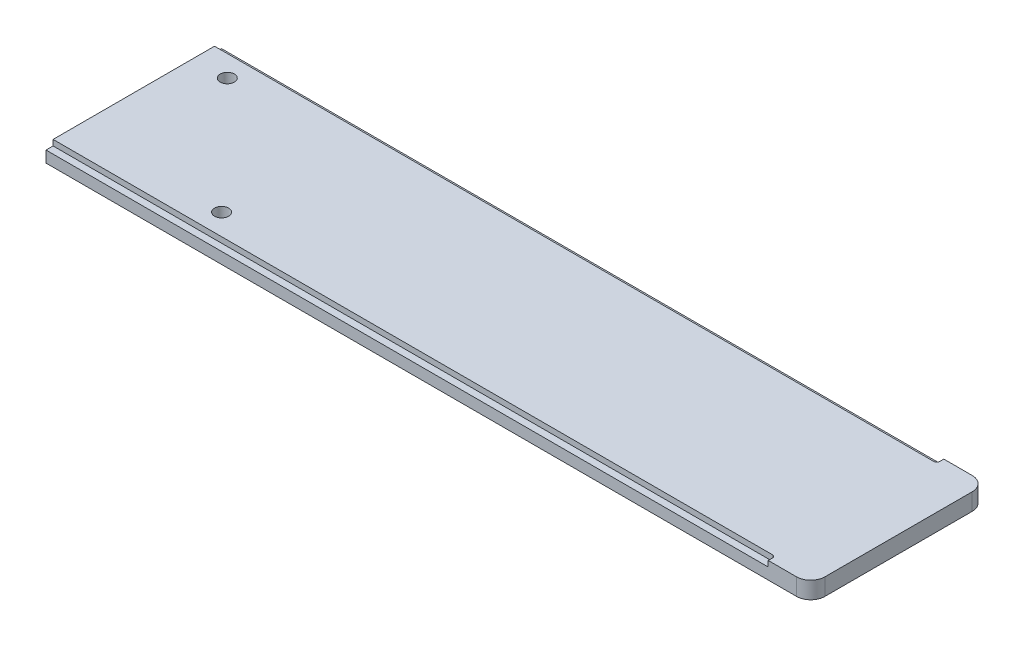
ISO-10303-21;
HEADER;
FILE_DESCRIPTION(('STEP AP214'),'2;1');
FILE_NAME('part.step','',(''),(''),'','','');
FILE_SCHEMA(('AUTOMOTIVE_DESIGN { 1 0 10303 214 1 1 1 1 }'));
ENDSEC;
DATA;
#1=APPLICATION_CONTEXT('core data for automotive mechanical design processes');
#2=APPLICATION_PROTOCOL_DEFINITION('international standard','automotive_design',2000,#1);
#3=PRODUCT_CONTEXT('',#1,'mechanical');
#4=PRODUCT('Part','Part','',(#3));
#5=PRODUCT_RELATED_PRODUCT_CATEGORY('part','',(#4));
#6=PRODUCT_DEFINITION_FORMATION('','',#4);
#7=PRODUCT_DEFINITION_CONTEXT('part definition',#1,'design');
#8=PRODUCT_DEFINITION('design','',#6,#7);
#9=PRODUCT_DEFINITION_SHAPE('','',#8);
#10=(LENGTH_UNIT() NAMED_UNIT(*) SI_UNIT(.MILLI.,.METRE.));
#11=(NAMED_UNIT(*) PLANE_ANGLE_UNIT() SI_UNIT($,.RADIAN.));
#12=(NAMED_UNIT(*) SI_UNIT($,.STERADIAN.) SOLID_ANGLE_UNIT());
#13=UNCERTAINTY_MEASURE_WITH_UNIT(LENGTH_MEASURE(1.E-05),#10,'distance_accuracy_value','');
#14=(GEOMETRIC_REPRESENTATION_CONTEXT(3) GLOBAL_UNCERTAINTY_ASSIGNED_CONTEXT((#13)) GLOBAL_UNIT_ASSIGNED_CONTEXT((#10,
#11,#12)) REPRESENTATION_CONTEXT('',''));
#15=CARTESIAN_POINT('',(0.,0.,0.));
#16=DIRECTION('',(0.,0.,1.));
#17=DIRECTION('',(1.,0.,0.));
#18=AXIS2_PLACEMENT_3D('',#15,#16,#17);
#19=CARTESIAN_POINT('',(0.,6.,0.));
#20=DIRECTION('',(1.,0.,0.));
#21=DIRECTION('',(0.,0.,-1.));
#22=AXIS2_PLACEMENT_3D('',#19,#20,#21);
#23=PLANE('',#22);
#24=DIRECTION('',(0.,0.,1.));
#25=VECTOR('',#24,1.);
#26=CARTESIAN_POINT('',(0.,6.,0.));
#27=LINE('',#26,#25);
#28=CARTESIAN_POINT('',(0.,6.,-59.5));
#29=VERTEX_POINT('',#28);
#30=CARTESIAN_POINT('',(0.,6.,-2.5));
#31=VERTEX_POINT('',#30);
#32=EDGE_CURVE('E167',#29,#31,#27,.T.);
#33=ORIENTED_EDGE('',*,*,#32,.F.);
#34=DIRECTION('',(0.,1.,0.));
#35=VECTOR('',#34,1.);
#36=CARTESIAN_POINT('',(0.,4.,-59.5));
#37=LINE('',#36,#35);
#38=CARTESIAN_POINT('',(0.,4.,-59.5));
#39=VERTEX_POINT('',#38);
#40=EDGE_CURVE('E146',#39,#29,#37,.T.);
#41=ORIENTED_EDGE('',*,*,#40,.F.);
#42=DIRECTION('',(0.,0.,1.));
#43=VECTOR('',#42,1.);
#44=CARTESIAN_POINT('',(0.,4.,-62.));
#45=LINE('',#44,#43);
#46=CARTESIAN_POINT('',(0.,4.,-62.));
#47=VERTEX_POINT('',#46);
#48=EDGE_CURVE('E153',#47,#39,#45,.T.);
#49=ORIENTED_EDGE('',*,*,#48,.F.);
#50=DIRECTION('',(0.,-1.,0.));
#51=VECTOR('',#50,1.);
#52=CARTESIAN_POINT('',(0.,6.,-62.));
#53=LINE('',#52,#51);
#54=CARTESIAN_POINT('',(0.,0.,-62.));
#55=VERTEX_POINT('',#54);
#56=EDGE_CURVE('E205',#47,#55,#53,.T.);
#57=ORIENTED_EDGE('',*,*,#56,.T.);
#58=DIRECTION('',(0.,0.,1.));
#59=VECTOR('',#58,1.);
#60=CARTESIAN_POINT('',(0.,0.,0.));
#61=LINE('',#60,#59);
#62=CARTESIAN_POINT('',(0.,0.,0.));
#63=VERTEX_POINT('',#62);
#64=EDGE_CURVE('E171',#55,#63,#61,.T.);
#65=ORIENTED_EDGE('',*,*,#64,.T.);
#66=DIRECTION('',(0.,-1.,0.));
#67=VECTOR('',#66,1.);
#68=CARTESIAN_POINT('',(0.,6.,0.));
#69=LINE('',#68,#67);
#70=CARTESIAN_POINT('',(0.,4.,0.));
#71=VERTEX_POINT('',#70);
#72=EDGE_CURVE('E214',#71,#63,#69,.T.);
#73=ORIENTED_EDGE('',*,*,#72,.F.);
#74=DIRECTION('',(0.,0.,1.));
#75=VECTOR('',#74,1.);
#76=CARTESIAN_POINT('',(0.,4.,0.));
#77=LINE('',#76,#75);
#78=CARTESIAN_POINT('',(0.,4.,-2.5));
#79=VERTEX_POINT('',#78);
#80=EDGE_CURVE('E185',#79,#71,#77,.T.);
#81=ORIENTED_EDGE('',*,*,#80,.F.);
#82=DIRECTION('',(0.,1.,0.));
#83=VECTOR('',#82,1.);
#84=CARTESIAN_POINT('',(0.,4.,-2.5));
#85=LINE('',#84,#83);
#86=EDGE_CURVE('E179',#79,#31,#85,.T.);
#87=ORIENTED_EDGE('',*,*,#86,.T.);
#88=EDGE_LOOP('',(#33,#41,#49,#57,#65,#73,#81,#87));
#89=FACE_BOUND('',#88,.T.);
#90=ADVANCED_FACE('F39',(#89),#23,.F.);
#91=CARTESIAN_POINT('',(0.,6.,0.));
#92=DIRECTION('',(0.,0.,-1.));
#93=DIRECTION('',(-1.,0.,0.));
#94=AXIS2_PLACEMENT_3D('',#91,#92,#93);
#95=PLANE('',#94);
#96=DIRECTION('',(1.,0.,0.));
#97=VECTOR('',#96,1.);
#98=CARTESIAN_POINT('',(0.,0.,0.));
#99=LINE('',#98,#97);
#100=CARTESIAN_POINT('',(265.,0.,0.));
#101=VERTEX_POINT('',#100);
#102=EDGE_CURVE('E208',#63,#101,#99,.T.);
#103=ORIENTED_EDGE('',*,*,#102,.T.);
#104=DIRECTION('',(0.,-1.,0.));
#105=VECTOR('',#104,1.);
#106=CARTESIAN_POINT('',(265.,6.,0.));
#107=LINE('',#106,#105);
#108=CARTESIAN_POINT('',(265.,6.,0.));
#109=VERTEX_POINT('',#108);
#110=EDGE_CURVE('E11',#101,#109,#107,.F.);
#111=ORIENTED_EDGE('',*,*,#110,.T.);
#112=DIRECTION('',(1.,0.,0.));
#113=VECTOR('',#112,1.);
#114=CARTESIAN_POINT('',(0.,6.,0.));
#115=LINE('',#114,#113);
#116=CARTESIAN_POINT('',(255.,6.,0.));
#117=VERTEX_POINT('',#116);
#118=EDGE_CURVE('E198',#117,#109,#115,.T.);
#119=ORIENTED_EDGE('',*,*,#118,.F.);
#120=DIRECTION('',(0.,1.,0.));
#121=VECTOR('',#120,1.);
#122=CARTESIAN_POINT('',(255.,4.,0.));
#123=LINE('',#122,#121);
#124=CARTESIAN_POINT('',(255.,4.,0.));
#125=VERTEX_POINT('',#124);
#126=EDGE_CURVE('E176',#125,#117,#123,.T.);
#127=ORIENTED_EDGE('',*,*,#126,.F.);
#128=DIRECTION('',(1.,0.,0.));
#129=VECTOR('',#128,1.);
#130=CARTESIAN_POINT('',(0.,4.,0.));
#131=LINE('',#130,#129);
#132=EDGE_CURVE('E193',#71,#125,#131,.T.);
#133=ORIENTED_EDGE('',*,*,#132,.F.);
#134=ORIENTED_EDGE('',*,*,#72,.T.);
#135=EDGE_LOOP('',(#103,#111,#119,#127,#133,#134));
#136=FACE_BOUND('',#135,.T.);
#137=ADVANCED_FACE('F267',(#136),#95,.F.);
#138=CARTESIAN_POINT('',(270.,6.,0.));
#139=DIRECTION('',(-1.,0.,0.));
#140=DIRECTION('',(0.,0.,1.));
#141=AXIS2_PLACEMENT_3D('',#138,#139,#140);
#142=PLANE('',#141);
#143=DIRECTION('',(0.,0.,-1.));
#144=VECTOR('',#143,1.);
#145=CARTESIAN_POINT('',(270.,0.,0.));
#146=LINE('',#145,#144);
#147=CARTESIAN_POINT('',(270.,0.,-5.));
#148=VERTEX_POINT('',#147);
#149=CARTESIAN_POINT('',(270.,0.,-57.));
#150=VERTEX_POINT('',#149);
#151=EDGE_CURVE('E210',#148,#150,#146,.T.);
#152=ORIENTED_EDGE('',*,*,#151,.T.);
#153=DIRECTION('',(0.,-1.,0.));
#154=VECTOR('',#153,1.);
#155=CARTESIAN_POINT('',(270.,6.,-57.));
#156=LINE('',#155,#154);
#157=CARTESIAN_POINT('',(270.,6.,-57.));
#158=VERTEX_POINT('',#157);
#159=EDGE_CURVE('E60',#150,#158,#156,.F.);
#160=ORIENTED_EDGE('',*,*,#159,.T.);
#161=DIRECTION('',(0.,0.,-1.));
#162=VECTOR('',#161,1.);
#163=CARTESIAN_POINT('',(270.,6.,0.));
#164=LINE('',#163,#162);
#165=CARTESIAN_POINT('',(270.,6.,-5.));
#166=VERTEX_POINT('',#165);
#167=EDGE_CURVE('E201',#166,#158,#164,.T.);
#168=ORIENTED_EDGE('',*,*,#167,.F.);
#169=DIRECTION('',(0.,-1.,0.));
#170=VECTOR('',#169,1.);
#171=CARTESIAN_POINT('',(270.,6.,-5.));
#172=LINE('',#171,#170);
#173=EDGE_CURVE('E240',#166,#148,#172,.T.);
#174=ORIENTED_EDGE('',*,*,#173,.T.);
#175=EDGE_LOOP('',(#152,#160,#168,#174));
#176=FACE_BOUND('',#175,.T.);
#177=ADVANCED_FACE('F262',(#176),#142,.F.);
#178=CARTESIAN_POINT('',(0.,6.,-62.));
#179=DIRECTION('',(0.,0.,1.));
#180=DIRECTION('',(1.,0.,0.));
#181=AXIS2_PLACEMENT_3D('',#178,#179,#180);
#182=PLANE('',#181);
#183=DIRECTION('',(-1.,0.,0.));
#184=VECTOR('',#183,1.);
#185=CARTESIAN_POINT('',(0.,6.,-62.));
#186=LINE('',#185,#184);
#187=CARTESIAN_POINT('',(265.,6.,-62.));
#188=VERTEX_POINT('',#187);
#189=CARTESIAN_POINT('',(255.,6.,-62.));
#190=VERTEX_POINT('',#189);
#191=EDGE_CURVE('E203',#188,#190,#186,.T.);
#192=ORIENTED_EDGE('',*,*,#191,.F.);
#193=DIRECTION('',(0.,-1.,0.));
#194=VECTOR('',#193,1.);
#195=CARTESIAN_POINT('',(265.,6.,-62.));
#196=LINE('',#195,#194);
#197=CARTESIAN_POINT('',(265.,0.,-62.));
#198=VERTEX_POINT('',#197);
#199=EDGE_CURVE('E233',#188,#198,#196,.T.);
#200=ORIENTED_EDGE('',*,*,#199,.T.);
#201=DIRECTION('',(-1.,0.,0.));
#202=VECTOR('',#201,1.);
#203=CARTESIAN_POINT('',(0.,0.,-62.));
#204=LINE('',#203,#202);
#205=EDGE_CURVE('E199',#198,#55,#204,.T.);
#206=ORIENTED_EDGE('',*,*,#205,.T.);
#207=ORIENTED_EDGE('',*,*,#56,.F.);
#208=DIRECTION('',(-1.,0.,0.));
#209=VECTOR('',#208,1.);
#210=CARTESIAN_POINT('',(0.,4.,-62.));
#211=LINE('',#210,#209);
#212=CARTESIAN_POINT('',(255.,4.,-62.));
#213=VERTEX_POINT('',#212);
#214=EDGE_CURVE('E158',#213,#47,#211,.T.);
#215=ORIENTED_EDGE('',*,*,#214,.F.);
#216=DIRECTION('',(0.,1.,0.));
#217=VECTOR('',#216,1.);
#218=CARTESIAN_POINT('',(255.,4.,-62.));
#219=LINE('',#218,#217);
#220=EDGE_CURVE('E168',#213,#190,#219,.T.);
#221=ORIENTED_EDGE('',*,*,#220,.T.);
#222=EDGE_LOOP('',(#192,#200,#206,#207,#215,#221));
#223=FACE_BOUND('',#222,.T.);
#224=ADVANCED_FACE('F254',(#223),#182,.F.);
#225=CARTESIAN_POINT('',(0.,6.,0.));
#226=DIRECTION('',(0.,-1.,0.));
#227=DIRECTION('',(0.,0.,-1.));
#228=AXIS2_PLACEMENT_3D('',#225,#226,#227);
#229=PLANE('',#228);
#230=CARTESIAN_POINT('',(12.,6.,-52.));
#231=DIRECTION('',(0.,1.,0.));
#232=DIRECTION('',(0.,0.,1.));
#233=AXIS2_PLACEMENT_3D('',#230,#231,#232);
#234=CIRCLE('',#233,2.5);
#235=CARTESIAN_POINT('',(12.,6.,-49.5));
#236=VERTEX_POINT('',#235);
#237=EDGE_CURVE('E291',#236,#236,#234,.T.);
#238=ORIENTED_EDGE('',*,*,#237,.F.);
#239=EDGE_LOOP('',(#238));
#240=FACE_BOUND('',#239,.T.);
#241=CARTESIAN_POINT('',(52.,6.,-10.));
#242=DIRECTION('',(0.,1.,0.));
#243=DIRECTION('',(0.,0.,1.));
#244=AXIS2_PLACEMENT_3D('',#241,#242,#243);
#245=CIRCLE('',#244,2.49999999999999);
#246=CARTESIAN_POINT('',(52.,6.,-7.50000000000001));
#247=VERTEX_POINT('',#246);
#248=EDGE_CURVE('E288',#247,#247,#245,.T.);
#249=ORIENTED_EDGE('',*,*,#248,.F.);
#250=EDGE_LOOP('',(#249));
#251=FACE_BOUND('',#250,.T.);
#252=ORIENTED_EDGE('',*,*,#167,.T.);
#253=CARTESIAN_POINT('',(265.,6.,-57.));
#254=DIRECTION('',(0.,-1.,0.));
#255=DIRECTION('',(0.,0.,-1.));
#256=AXIS2_PLACEMENT_3D('',#253,#254,#255);
#257=CIRCLE('',#256,5.);
#258=EDGE_CURVE('E47',#158,#188,#257,.F.);
#259=ORIENTED_EDGE('',*,*,#258,.T.);
#260=ORIENTED_EDGE('',*,*,#191,.T.);
#261=DIRECTION('',(0.,0.,-1.));
#262=VECTOR('',#261,1.);
#263=CARTESIAN_POINT('',(255.,6.,-62.));
#264=LINE('',#263,#262);
#265=CARTESIAN_POINT('',(255.,6.,-60.5));
#266=VERTEX_POINT('',#265);
#267=EDGE_CURVE('E162',#266,#190,#264,.T.);
#268=ORIENTED_EDGE('',*,*,#267,.F.);
#269=CARTESIAN_POINT('',(254.,6.,-60.5));
#270=DIRECTION('',(0.,-1.,0.));
#271=DIRECTION('',(0.,0.,-1.));
#272=AXIS2_PLACEMENT_3D('',#269,#270,#271);
#273=CIRCLE('',#272,1.);
#274=CARTESIAN_POINT('',(254.,6.,-59.5));
#275=VERTEX_POINT('',#274);
#276=EDGE_CURVE('E231',#266,#275,#273,.T.);
#277=ORIENTED_EDGE('',*,*,#276,.T.);
#278=DIRECTION('',(1.,0.,0.));
#279=VECTOR('',#278,1.);
#280=CARTESIAN_POINT('',(0.,6.,-59.5));
#281=LINE('',#280,#279);
#282=EDGE_CURVE('E188',#29,#275,#281,.T.);
#283=ORIENTED_EDGE('',*,*,#282,.F.);
#284=ORIENTED_EDGE('',*,*,#32,.T.);
#285=DIRECTION('',(-1.,0.,0.));
#286=VECTOR('',#285,1.);
#287=CARTESIAN_POINT('',(0.,6.,-2.5));
#288=LINE('',#287,#286);
#289=CARTESIAN_POINT('',(254.,6.,-2.5));
#290=VERTEX_POINT('',#289);
#291=EDGE_CURVE('E182',#290,#31,#288,.T.);
#292=ORIENTED_EDGE('',*,*,#291,.F.);
#293=CARTESIAN_POINT('',(254.,6.,-1.5));
#294=DIRECTION('',(0.,-1.,0.));
#295=DIRECTION('',(0.,0.,-1.));
#296=AXIS2_PLACEMENT_3D('',#293,#294,#295);
#297=CIRCLE('',#296,1.);
#298=CARTESIAN_POINT('',(255.,6.,-1.5));
#299=VERTEX_POINT('',#298);
#300=EDGE_CURVE('E229',#290,#299,#297,.T.);
#301=ORIENTED_EDGE('',*,*,#300,.T.);
#302=DIRECTION('',(0.,0.,-1.));
#303=VECTOR('',#302,1.);
#304=CARTESIAN_POINT('',(255.,6.,0.));
#305=LINE('',#304,#303);
#306=EDGE_CURVE('E184',#117,#299,#305,.T.);
#307=ORIENTED_EDGE('',*,*,#306,.F.);
#308=ORIENTED_EDGE('',*,*,#118,.T.);
#309=CARTESIAN_POINT('',(265.,6.,-5.));
#310=DIRECTION('',(0.,-1.,0.));
#311=DIRECTION('',(0.,0.,-1.));
#312=AXIS2_PLACEMENT_3D('',#309,#310,#311);
#313=CIRCLE('',#312,5.);
#314=EDGE_CURVE('E244',#109,#166,#313,.F.);
#315=ORIENTED_EDGE('',*,*,#314,.T.);
#316=EDGE_LOOP('',(#252,#259,#260,#268,#277,#283,#284,#292,#301,#307,#308,#315));
#317=FACE_BOUND('',#316,.T.);
#318=ADVANCED_FACE('F248',(#240,#251,#317),#229,.F.);
#319=CARTESIAN_POINT('',(0.,0.,0.));
#320=DIRECTION('',(0.,-1.,0.));
#321=DIRECTION('',(0.,0.,-1.));
#322=AXIS2_PLACEMENT_3D('',#319,#320,#321);
#323=PLANE('',#322);
#324=CARTESIAN_POINT('',(12.,0.,-52.));
#325=DIRECTION('',(0.,1.,0.));
#326=DIRECTION('',(0.,0.,1.));
#327=AXIS2_PLACEMENT_3D('',#324,#325,#326);
#328=CIRCLE('',#327,2.5);
#329=CARTESIAN_POINT('',(12.,0.,-49.5));
#330=VERTEX_POINT('',#329);
#331=EDGE_CURVE('E181',#330,#330,#328,.T.);
#332=ORIENTED_EDGE('',*,*,#331,.T.);
#333=EDGE_LOOP('',(#332));
#334=FACE_BOUND('',#333,.T.);
#335=CARTESIAN_POINT('',(52.,0.,-10.));
#336=DIRECTION('',(0.,1.,0.));
#337=DIRECTION('',(0.,0.,1.));
#338=AXIS2_PLACEMENT_3D('',#335,#336,#337);
#339=CIRCLE('',#338,2.49999999999999);
#340=CARTESIAN_POINT('',(52.,0.,-7.50000000000001));
#341=VERTEX_POINT('',#340);
#342=EDGE_CURVE('E285',#341,#341,#339,.T.);
#343=ORIENTED_EDGE('',*,*,#342,.T.);
#344=EDGE_LOOP('',(#343));
#345=FACE_BOUND('',#344,.T.);
#346=ORIENTED_EDGE('',*,*,#205,.F.);
#347=CARTESIAN_POINT('',(265.,0.,-57.));
#348=DIRECTION('',(0.,-1.,0.));
#349=DIRECTION('',(0.,0.,-1.));
#350=AXIS2_PLACEMENT_3D('',#347,#348,#349);
#351=CIRCLE('',#350,5.);
#352=EDGE_CURVE('E238',#198,#150,#351,.T.);
#353=ORIENTED_EDGE('',*,*,#352,.T.);
#354=ORIENTED_EDGE('',*,*,#151,.F.);
#355=CARTESIAN_POINT('',(265.,0.,-5.));
#356=DIRECTION('',(0.,-1.,0.));
#357=DIRECTION('',(0.,0.,-1.));
#358=AXIS2_PLACEMENT_3D('',#355,#356,#357);
#359=CIRCLE('',#358,5.);
#360=EDGE_CURVE('E236',#148,#101,#359,.T.);
#361=ORIENTED_EDGE('',*,*,#360,.T.);
#362=ORIENTED_EDGE('',*,*,#102,.F.);
#363=ORIENTED_EDGE('',*,*,#64,.F.);
#364=EDGE_LOOP('',(#346,#353,#354,#361,#362,#363));
#365=FACE_BOUND('',#364,.T.);
#366=ADVANCED_FACE('F260',(#334,#345,#365),#323,.T.);
#367=CARTESIAN_POINT('',(0.,4.,-2.5));
#368=DIRECTION('',(0.,0.,-1.));
#369=DIRECTION('',(-1.,0.,0.));
#370=AXIS2_PLACEMENT_3D('',#367,#368,#369);
#371=PLANE('',#370);
#372=DIRECTION('',(-1.,0.,0.));
#373=VECTOR('',#372,1.);
#374=CARTESIAN_POINT('',(0.,4.,-2.5));
#375=LINE('',#374,#373);
#376=CARTESIAN_POINT('',(254.,4.,-2.5));
#377=VERTEX_POINT('',#376);
#378=EDGE_CURVE('E178',#377,#79,#375,.T.);
#379=ORIENTED_EDGE('',*,*,#378,.F.);
#380=DIRECTION('',(0.,1.,0.));
#381=VECTOR('',#380,1.);
#382=CARTESIAN_POINT('',(254.,6.,-2.5));
#383=LINE('',#382,#381);
#384=EDGE_CURVE('E216',#377,#290,#383,.T.);
#385=ORIENTED_EDGE('',*,*,#384,.T.);
#386=ORIENTED_EDGE('',*,*,#291,.T.);
#387=ORIENTED_EDGE('',*,*,#86,.F.);
#388=EDGE_LOOP('',(#379,#385,#386,#387));
#389=FACE_BOUND('',#388,.T.);
#390=ADVANCED_FACE('F279',(#389),#371,.F.);
#391=CARTESIAN_POINT('',(255.,4.,0.));
#392=DIRECTION('',(1.,0.,0.));
#393=DIRECTION('',(0.,0.,-1.));
#394=AXIS2_PLACEMENT_3D('',#391,#392,#393);
#395=PLANE('',#394);
#396=ORIENTED_EDGE('',*,*,#306,.T.);
#397=DIRECTION('',(0.,1.,0.));
#398=VECTOR('',#397,1.);
#399=CARTESIAN_POINT('',(255.,4.,-1.5));
#400=LINE('',#399,#398);
#401=CARTESIAN_POINT('',(255.,4.,-1.5));
#402=VERTEX_POINT('',#401);
#403=EDGE_CURVE('E219',#299,#402,#400,.F.);
#404=ORIENTED_EDGE('',*,*,#403,.T.);
#405=DIRECTION('',(0.,0.,-1.));
#406=VECTOR('',#405,1.);
#407=CARTESIAN_POINT('',(255.,4.,0.));
#408=LINE('',#407,#406);
#409=EDGE_CURVE('E190',#125,#402,#408,.T.);
#410=ORIENTED_EDGE('',*,*,#409,.F.);
#411=ORIENTED_EDGE('',*,*,#126,.T.);
#412=EDGE_LOOP('',(#396,#404,#410,#411));
#413=FACE_BOUND('',#412,.T.);
#414=ADVANCED_FACE('F451',(#413),#395,.F.);
#415=CARTESIAN_POINT('',(0.,4.,0.));
#416=DIRECTION('',(0.,-1.,0.));
#417=DIRECTION('',(0.,0.,-1.));
#418=AXIS2_PLACEMENT_3D('',#415,#416,#417);
#419=PLANE('',#418);
#420=ORIENTED_EDGE('',*,*,#409,.T.);
#421=CARTESIAN_POINT('',(254.,4.,-1.5));
#422=DIRECTION('',(0.,-1.,0.));
#423=DIRECTION('',(0.,0.,-1.));
#424=AXIS2_PLACEMENT_3D('',#421,#422,#423);
#425=CIRCLE('',#424,1.);
#426=EDGE_CURVE('E221',#402,#377,#425,.F.);
#427=ORIENTED_EDGE('',*,*,#426,.T.);
#428=ORIENTED_EDGE('',*,*,#378,.T.);
#429=ORIENTED_EDGE('',*,*,#80,.T.);
#430=ORIENTED_EDGE('',*,*,#132,.T.);
#431=EDGE_LOOP('',(#420,#427,#428,#429,#430));
#432=FACE_BOUND('',#431,.T.);
#433=ADVANCED_FACE('F274',(#432),#419,.F.);
#434=CARTESIAN_POINT('',(255.,4.,-62.));
#435=DIRECTION('',(1.,0.,0.));
#436=DIRECTION('',(0.,0.,-1.));
#437=AXIS2_PLACEMENT_3D('',#434,#435,#436);
#438=PLANE('',#437);
#439=DIRECTION('',(0.,0.,-1.));
#440=VECTOR('',#439,1.);
#441=CARTESIAN_POINT('',(255.,4.,-62.));
#442=LINE('',#441,#440);
#443=CARTESIAN_POINT('',(255.,4.,-60.5));
#444=VERTEX_POINT('',#443);
#445=EDGE_CURVE('E152',#444,#213,#442,.T.);
#446=ORIENTED_EDGE('',*,*,#445,.F.);
#447=DIRECTION('',(0.,1.,0.));
#448=VECTOR('',#447,1.);
#449=CARTESIAN_POINT('',(255.,6.,-60.5));
#450=LINE('',#449,#448);
#451=EDGE_CURVE('E223',#444,#266,#450,.T.);
#452=ORIENTED_EDGE('',*,*,#451,.T.);
#453=ORIENTED_EDGE('',*,*,#267,.T.);
#454=ORIENTED_EDGE('',*,*,#220,.F.);
#455=EDGE_LOOP('',(#446,#452,#453,#454));
#456=FACE_BOUND('',#455,.T.);
#457=ADVANCED_FACE('F431',(#456),#438,.F.);
#458=CARTESIAN_POINT('',(0.,4.,-59.5));
#459=DIRECTION('',(0.,0.,1.));
#460=DIRECTION('',(1.,0.,0.));
#461=AXIS2_PLACEMENT_3D('',#458,#459,#460);
#462=PLANE('',#461);
#463=ORIENTED_EDGE('',*,*,#282,.T.);
#464=DIRECTION('',(0.,1.,0.));
#465=VECTOR('',#464,1.);
#466=CARTESIAN_POINT('',(254.,4.,-59.5));
#467=LINE('',#466,#465);
#468=CARTESIAN_POINT('',(254.,4.,-59.5));
#469=VERTEX_POINT('',#468);
#470=EDGE_CURVE('E149',#275,#469,#467,.F.);
#471=ORIENTED_EDGE('',*,*,#470,.T.);
#472=DIRECTION('',(1.,0.,0.));
#473=VECTOR('',#472,1.);
#474=CARTESIAN_POINT('',(0.,4.,-59.5));
#475=LINE('',#474,#473);
#476=EDGE_CURVE('E141',#39,#469,#475,.T.);
#477=ORIENTED_EDGE('',*,*,#476,.F.);
#478=ORIENTED_EDGE('',*,*,#40,.T.);
#479=EDGE_LOOP('',(#463,#471,#477,#478));
#480=FACE_BOUND('',#479,.T.);
#481=ADVANCED_FACE('F144',(#480),#462,.F.);
#482=CARTESIAN_POINT('',(0.,4.,0.));
#483=DIRECTION('',(0.,1.,0.));
#484=DIRECTION('',(0.,0.,1.));
#485=AXIS2_PLACEMENT_3D('',#482,#483,#484);
#486=PLANE('',#485);
#487=ORIENTED_EDGE('',*,*,#476,.T.);
#488=CARTESIAN_POINT('',(254.,4.,-60.5));
#489=DIRECTION('',(0.,1.,0.));
#490=DIRECTION('',(0.,0.,1.));
#491=AXIS2_PLACEMENT_3D('',#488,#489,#490);
#492=CIRCLE('',#491,1.);
#493=EDGE_CURVE('E227',#469,#444,#492,.T.);
#494=ORIENTED_EDGE('',*,*,#493,.T.);
#495=ORIENTED_EDGE('',*,*,#445,.T.);
#496=ORIENTED_EDGE('',*,*,#214,.T.);
#497=ORIENTED_EDGE('',*,*,#48,.T.);
#498=EDGE_LOOP('',(#487,#494,#495,#496,#497));
#499=FACE_BOUND('',#498,.T.);
#500=ADVANCED_FACE('F156',(#499),#486,.T.);
#501=CARTESIAN_POINT('',(254.,4.,-1.5));
#502=DIRECTION('',(0.,-1.,0.));
#503=DIRECTION('',(0.,0.,-1.));
#504=AXIS2_PLACEMENT_3D('',#501,#502,#503);
#505=CYLINDRICAL_SURFACE('',#504,1.);
#506=ORIENTED_EDGE('',*,*,#426,.F.);
#507=ORIENTED_EDGE('',*,*,#403,.F.);
#508=ORIENTED_EDGE('',*,*,#300,.F.);
#509=ORIENTED_EDGE('',*,*,#384,.F.);
#510=EDGE_LOOP('',(#506,#507,#508,#509));
#511=FACE_BOUND('',#510,.T.);
#512=ADVANCED_FACE('F318',(#511),#505,.F.);
#513=CARTESIAN_POINT('',(254.,4.,-60.5));
#514=DIRECTION('',(0.,-1.,0.));
#515=DIRECTION('',(0.,0.,-1.));
#516=AXIS2_PLACEMENT_3D('',#513,#514,#515);
#517=CYLINDRICAL_SURFACE('',#516,1.);
#518=ORIENTED_EDGE('',*,*,#493,.F.);
#519=ORIENTED_EDGE('',*,*,#470,.F.);
#520=ORIENTED_EDGE('',*,*,#276,.F.);
#521=ORIENTED_EDGE('',*,*,#451,.F.);
#522=EDGE_LOOP('',(#518,#519,#520,#521));
#523=FACE_BOUND('',#522,.T.);
#524=ADVANCED_FACE('F312',(#523),#517,.F.);
#525=CARTESIAN_POINT('',(52.,0.,-10.));
#526=DIRECTION('',(0.,1.,0.));
#527=DIRECTION('',(0.,0.,1.));
#528=AXIS2_PLACEMENT_3D('',#525,#526,#527);
#529=CYLINDRICAL_SURFACE('',#528,2.49999999999999);
#530=ORIENTED_EDGE('',*,*,#342,.F.);
#531=EDGE_LOOP('',(#530));
#532=FACE_BOUND('',#531,.T.);
#533=ORIENTED_EDGE('',*,*,#248,.T.);
#534=EDGE_LOOP('',(#533));
#535=FACE_BOUND('',#534,.T.);
#536=ADVANCED_FACE('F302',(#532,#535),#529,.F.);
#537=CARTESIAN_POINT('',(12.,0.,-52.));
#538=DIRECTION('',(0.,1.,0.));
#539=DIRECTION('',(0.,0.,1.));
#540=AXIS2_PLACEMENT_3D('',#537,#538,#539);
#541=CYLINDRICAL_SURFACE('',#540,2.5);
#542=ORIENTED_EDGE('',*,*,#331,.F.);
#543=EDGE_LOOP('',(#542));
#544=FACE_BOUND('',#543,.T.);
#545=ORIENTED_EDGE('',*,*,#237,.T.);
#546=EDGE_LOOP('',(#545));
#547=FACE_BOUND('',#546,.T.);
#548=ADVANCED_FACE('F299',(#544,#547),#541,.F.);
#549=CARTESIAN_POINT('',(265.,6.,-57.));
#550=DIRECTION('',(0.,-1.,0.));
#551=DIRECTION('',(0.,0.,-1.));
#552=AXIS2_PLACEMENT_3D('',#549,#550,#551);
#553=CYLINDRICAL_SURFACE('',#552,5.);
#554=ORIENTED_EDGE('',*,*,#258,.F.);
#555=ORIENTED_EDGE('',*,*,#159,.F.);
#556=ORIENTED_EDGE('',*,*,#352,.F.);
#557=ORIENTED_EDGE('',*,*,#199,.F.);
#558=EDGE_LOOP('',(#554,#555,#556,#557));
#559=FACE_BOUND('',#558,.T.);
#560=ADVANCED_FACE('F257',(#559),#553,.T.);
#561=CARTESIAN_POINT('',(265.,6.,-5.));
#562=DIRECTION('',(0.,-1.,0.));
#563=DIRECTION('',(0.,0.,-1.));
#564=AXIS2_PLACEMENT_3D('',#561,#562,#563);
#565=CYLINDRICAL_SURFACE('',#564,5.);
#566=ORIENTED_EDGE('',*,*,#314,.F.);
#567=ORIENTED_EDGE('',*,*,#110,.F.);
#568=ORIENTED_EDGE('',*,*,#360,.F.);
#569=ORIENTED_EDGE('',*,*,#173,.F.);
#570=EDGE_LOOP('',(#566,#567,#568,#569));
#571=FACE_BOUND('',#570,.T.);
#572=ADVANCED_FACE('F41',(#571),#565,.T.);
#573=CLOSED_SHELL('',(#90,#137,#177,#224,#318,#366,#390,#414,#433,#457,#481,#500,#512,#524,#536,
#548,#560,#572));
#574=MANIFOLD_SOLID_BREP('B2',#573);
#575=ADVANCED_BREP_SHAPE_REPRESENTATION('',(#18,#574),#14);
#576=SHAPE_DEFINITION_REPRESENTATION(#9,#575);
ENDSEC;
END-ISO-10303-21;
